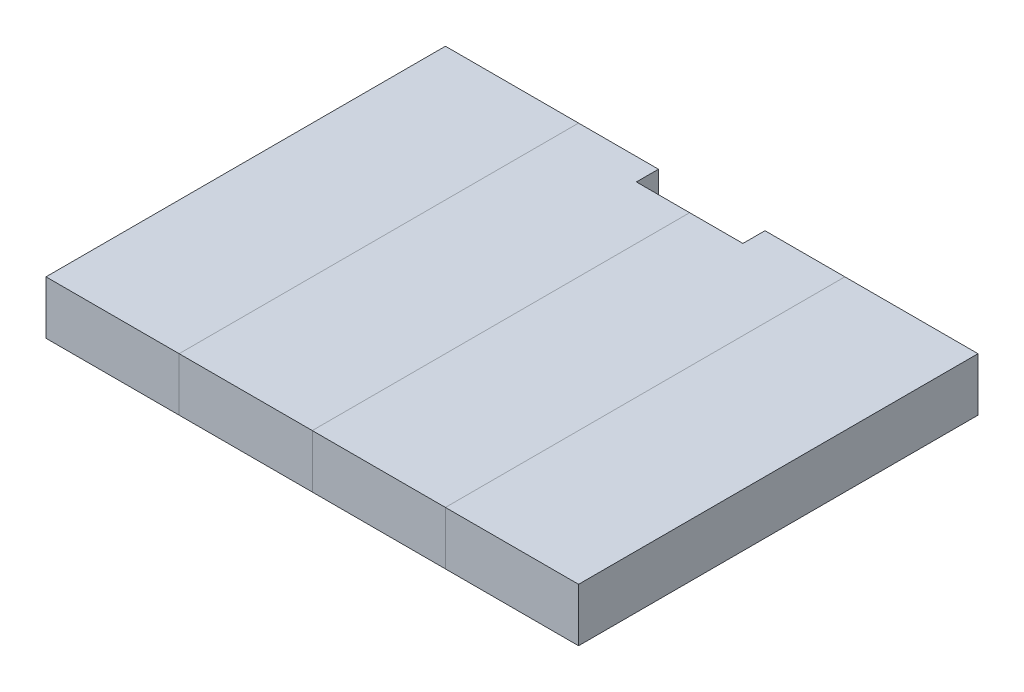
ISO-10303-21;
HEADER;
FILE_DESCRIPTION(('STEP AP214'),'2;1');
FILE_NAME('part.step','',(''),(''),'','','');
FILE_SCHEMA(('AUTOMOTIVE_DESIGN { 1 0 10303 214 1 1 1 1 }'));
ENDSEC;
DATA;
#1=APPLICATION_CONTEXT('core data for automotive mechanical design processes');
#2=APPLICATION_PROTOCOL_DEFINITION('international standard','automotive_design',2000,#1);
#3=PRODUCT_CONTEXT('',#1,'mechanical');
#4=PRODUCT('Part','Part','',(#3));
#5=PRODUCT_RELATED_PRODUCT_CATEGORY('part','',(#4));
#6=PRODUCT_DEFINITION_FORMATION('','',#4);
#7=PRODUCT_DEFINITION_CONTEXT('part definition',#1,'design');
#8=PRODUCT_DEFINITION('design','',#6,#7);
#9=PRODUCT_DEFINITION_SHAPE('','',#8);
#10=(LENGTH_UNIT() NAMED_UNIT(*) SI_UNIT(.MILLI.,.METRE.));
#11=(NAMED_UNIT(*) PLANE_ANGLE_UNIT() SI_UNIT($,.RADIAN.));
#12=(NAMED_UNIT(*) SI_UNIT($,.STERADIAN.) SOLID_ANGLE_UNIT());
#13=UNCERTAINTY_MEASURE_WITH_UNIT(LENGTH_MEASURE(1.E-05),#10,'distance_accuracy_value','');
#14=(GEOMETRIC_REPRESENTATION_CONTEXT(3) GLOBAL_UNCERTAINTY_ASSIGNED_CONTEXT((#13)) GLOBAL_UNIT_ASSIGNED_CONTEXT((#10,
#11,#12)) REPRESENTATION_CONTEXT('',''));
#15=CARTESIAN_POINT('',(0.,0.,0.));
#16=DIRECTION('',(0.,0.,1.));
#17=DIRECTION('',(1.,0.,0.));
#18=AXIS2_PLACEMENT_3D('',#15,#16,#17);
#19=CARTESIAN_POINT('',(0.,0.,0.));
#20=DIRECTION('',(0.,1.,0.));
#21=DIRECTION('',(0.,0.,1.));
#22=AXIS2_PLACEMENT_3D('',#19,#20,#21);
#23=PLANE('',#22);
#24=DIRECTION('',(0.,0.,1.));
#25=VECTOR('',#24,1.);
#26=CARTESIAN_POINT('',(-12.5,0.,-37.5));
#27=LINE('',#26,#25);
#28=CARTESIAN_POINT('',(-12.5,0.,-37.5));
#29=VERTEX_POINT('',#28);
#30=CARTESIAN_POINT('',(-12.5,0.,37.5));
#31=VERTEX_POINT('',#30);
#32=EDGE_CURVE('P0_E78',#29,#31,#27,.T.);
#33=ORIENTED_EDGE('',*,*,#32,.F.);
#34=DIRECTION('',(-1.,0.,0.));
#35=VECTOR('',#34,1.);
#36=CARTESIAN_POINT('',(12.5,0.,-37.5));
#37=LINE('',#36,#35);
#38=CARTESIAN_POINT('',(12.5,0.,-37.5));
#39=VERTEX_POINT('',#38);
#40=EDGE_CURVE('P0_E54',#39,#29,#37,.T.);
#41=ORIENTED_EDGE('',*,*,#40,.F.);
#42=DIRECTION('',(0.,0.,-1.));
#43=VECTOR('',#42,1.);
#44=CARTESIAN_POINT('',(12.5,0.,37.5));
#45=LINE('',#44,#43);
#46=CARTESIAN_POINT('',(12.5,0.,37.5));
#47=VERTEX_POINT('',#46);
#48=EDGE_CURVE('P0_E56',#47,#39,#45,.T.);
#49=ORIENTED_EDGE('',*,*,#48,.F.);
#50=DIRECTION('',(1.,0.,0.));
#51=VECTOR('',#50,1.);
#52=CARTESIAN_POINT('',(-12.5,0.,37.5));
#53=LINE('',#52,#51);
#54=EDGE_CURVE('P0_E19',#31,#47,#53,.T.);
#55=ORIENTED_EDGE('',*,*,#54,.F.);
#56=EDGE_LOOP('',(#33,#41,#49,#55));
#57=FACE_BOUND('',#56,.T.);
#58=ADVANCED_FACE('P0_F16',(#57),#23,.F.);
#59=CARTESIAN_POINT('',(-12.5,0.,37.5));
#60=DIRECTION('',(0.,0.,1.));
#61=DIRECTION('',(1.,0.,0.));
#62=AXIS2_PLACEMENT_3D('',#59,#60,#61);
#63=PLANE('',#62);
#64=DIRECTION('',(1.,0.,0.));
#65=VECTOR('',#64,1.);
#66=CARTESIAN_POINT('',(0.,10.,37.5));
#67=LINE('',#66,#65);
#68=CARTESIAN_POINT('',(-12.5,10.,37.5));
#69=VERTEX_POINT('',#68);
#70=CARTESIAN_POINT('',(12.5,10.,37.5));
#71=VERTEX_POINT('',#70);
#72=EDGE_CURVE('P0_E82',#69,#71,#67,.T.);
#73=ORIENTED_EDGE('',*,*,#72,.F.);
#74=DIRECTION('',(0.,1.,0.));
#75=VECTOR('',#74,1.);
#76=CARTESIAN_POINT('',(-12.5,0.,37.5));
#77=LINE('',#76,#75);
#78=EDGE_CURVE('P0_E67',#31,#69,#77,.T.);
#79=ORIENTED_EDGE('',*,*,#78,.F.);
#80=ORIENTED_EDGE('',*,*,#54,.T.);
#81=DIRECTION('',(0.,1.,0.));
#82=VECTOR('',#81,1.);
#83=CARTESIAN_POINT('',(12.5,0.,37.5));
#84=LINE('',#83,#82);
#85=EDGE_CURVE('P0_E62',#71,#47,#84,.F.);
#86=ORIENTED_EDGE('',*,*,#85,.F.);
#87=EDGE_LOOP('',(#73,#79,#80,#86));
#88=FACE_BOUND('',#87,.T.);
#89=ADVANCED_FACE('P0_F64',(#88),#63,.T.);
#90=CARTESIAN_POINT('',(12.5,0.,37.5));
#91=DIRECTION('',(1.,0.,0.));
#92=DIRECTION('',(0.,0.,-1.));
#93=AXIS2_PLACEMENT_3D('',#90,#91,#92);
#94=PLANE('',#93);
#95=DIRECTION('',(0.,0.,1.));
#96=VECTOR('',#95,1.);
#97=CARTESIAN_POINT('',(12.5,10.,0.));
#98=LINE('',#97,#96);
#99=CARTESIAN_POINT('',(12.5,10.,-37.5));
#100=VERTEX_POINT('',#99);
#101=EDGE_CURVE('P0_E71',#71,#100,#98,.F.);
#102=ORIENTED_EDGE('',*,*,#101,.F.);
#103=ORIENTED_EDGE('',*,*,#85,.T.);
#104=ORIENTED_EDGE('',*,*,#48,.T.);
#105=DIRECTION('',(0.,1.,0.));
#106=VECTOR('',#105,1.);
#107=CARTESIAN_POINT('',(12.5,0.,-37.5));
#108=LINE('',#107,#106);
#109=EDGE_CURVE('P0_E74',#100,#39,#108,.F.);
#110=ORIENTED_EDGE('',*,*,#109,.F.);
#111=EDGE_LOOP('',(#102,#103,#104,#110));
#112=FACE_BOUND('',#111,.T.);
#113=ADVANCED_FACE('P0_F69',(#112),#94,.T.);
#114=CARTESIAN_POINT('',(12.5,0.,-37.5));
#115=DIRECTION('',(0.,0.,-1.));
#116=DIRECTION('',(-1.,0.,0.));
#117=AXIS2_PLACEMENT_3D('',#114,#115,#116);
#118=PLANE('',#117);
#119=DIRECTION('',(1.,0.,0.));
#120=VECTOR('',#119,1.);
#121=CARTESIAN_POINT('',(0.,10.,-37.5));
#122=LINE('',#121,#120);
#123=CARTESIAN_POINT('',(-12.5,10.,-37.5));
#124=VERTEX_POINT('',#123);
#125=EDGE_CURVE('P0_E25',#100,#124,#122,.F.);
#126=ORIENTED_EDGE('',*,*,#125,.F.);
#127=ORIENTED_EDGE('',*,*,#109,.T.);
#128=ORIENTED_EDGE('',*,*,#40,.T.);
#129=DIRECTION('',(0.,1.,0.));
#130=VECTOR('',#129,1.);
#131=CARTESIAN_POINT('',(-12.5,0.,-37.5));
#132=LINE('',#131,#130);
#133=EDGE_CURVE('P0_E34',#124,#29,#132,.F.);
#134=ORIENTED_EDGE('',*,*,#133,.F.);
#135=EDGE_LOOP('',(#126,#127,#128,#134));
#136=FACE_BOUND('',#135,.T.);
#137=ADVANCED_FACE('P0_F88',(#136),#118,.T.);
#138=CARTESIAN_POINT('',(-12.5,0.,-37.5));
#139=DIRECTION('',(-1.,0.,0.));
#140=DIRECTION('',(0.,0.,1.));
#141=AXIS2_PLACEMENT_3D('',#138,#139,#140);
#142=PLANE('',#141);
#143=DIRECTION('',(0.,0.,1.));
#144=VECTOR('',#143,1.);
#145=CARTESIAN_POINT('',(-12.5,10.,0.));
#146=LINE('',#145,#144);
#147=EDGE_CURVE('P0_E10',#124,#69,#146,.T.);
#148=ORIENTED_EDGE('',*,*,#147,.F.);
#149=ORIENTED_EDGE('',*,*,#133,.T.);
#150=ORIENTED_EDGE('',*,*,#32,.T.);
#151=ORIENTED_EDGE('',*,*,#78,.T.);
#152=EDGE_LOOP('',(#148,#149,#150,#151));
#153=FACE_BOUND('',#152,.T.);
#154=ADVANCED_FACE('P0_F90',(#153),#142,.T.);
#155=CARTESIAN_POINT('',(0.,10.,0.));
#156=DIRECTION('',(0.,1.,0.));
#157=DIRECTION('',(0.,0.,1.));
#158=AXIS2_PLACEMENT_3D('',#155,#156,#157);
#159=PLANE('',#158);
#160=ORIENTED_EDGE('',*,*,#125,.T.);
#161=ORIENTED_EDGE('',*,*,#147,.T.);
#162=ORIENTED_EDGE('',*,*,#72,.T.);
#163=ORIENTED_EDGE('',*,*,#101,.T.);
#164=EDGE_LOOP('',(#160,#161,#162,#163));
#165=FACE_BOUND('',#164,.T.);
#166=ADVANCED_FACE('P0_F87',(#165),#159,.T.);
#167=CLOSED_SHELL('',(#58,#89,#113,#137,#154,#166));
#168=MANIFOLD_SOLID_BREP('P0_B1',#167);
#169=CARTESIAN_POINT('',(75.,0.,0.));
#170=DIRECTION('',(0.,1.,0.));
#171=DIRECTION('',(0.,0.,1.));
#172=AXIS2_PLACEMENT_3D('',#169,#170,#171);
#173=PLANE('',#172);
#174=DIRECTION('',(0.,0.,1.));
#175=VECTOR('',#174,1.);
#176=CARTESIAN_POINT('',(62.5,0.,-37.5));
#177=LINE('',#176,#175);
#178=CARTESIAN_POINT('',(62.5,0.,-37.5));
#179=VERTEX_POINT('',#178);
#180=CARTESIAN_POINT('',(62.5,0.,37.5));
#181=VERTEX_POINT('',#180);
#182=EDGE_CURVE('P1_E79',#179,#181,#177,.T.);
#183=ORIENTED_EDGE('',*,*,#182,.F.);
#184=DIRECTION('',(-1.,0.,0.));
#185=VECTOR('',#184,1.);
#186=CARTESIAN_POINT('',(87.5,0.,-37.5));
#187=LINE('',#186,#185);
#188=CARTESIAN_POINT('',(87.5,0.,-37.5));
#189=VERTEX_POINT('',#188);
#190=EDGE_CURVE('P1_E55',#189,#179,#187,.T.);
#191=ORIENTED_EDGE('',*,*,#190,.F.);
#192=DIRECTION('',(0.,0.,-1.));
#193=VECTOR('',#192,1.);
#194=CARTESIAN_POINT('',(87.5,0.,37.5));
#195=LINE('',#194,#193);
#196=CARTESIAN_POINT('',(87.5,0.,37.5));
#197=VERTEX_POINT('',#196);
#198=EDGE_CURVE('P1_E57',#197,#189,#195,.T.);
#199=ORIENTED_EDGE('',*,*,#198,.F.);
#200=DIRECTION('',(1.,0.,0.));
#201=VECTOR('',#200,1.);
#202=CARTESIAN_POINT('',(62.5,0.,37.5));
#203=LINE('',#202,#201);
#204=EDGE_CURVE('P1_E20',#181,#197,#203,.T.);
#205=ORIENTED_EDGE('',*,*,#204,.F.);
#206=EDGE_LOOP('',(#183,#191,#199,#205));
#207=FACE_BOUND('',#206,.T.);
#208=ADVANCED_FACE('P1_F17',(#207),#173,.F.);
#209=CARTESIAN_POINT('',(62.5,0.,37.5));
#210=DIRECTION('',(0.,0.,1.));
#211=DIRECTION('',(1.,0.,0.));
#212=AXIS2_PLACEMENT_3D('',#209,#210,#211);
#213=PLANE('',#212);
#214=DIRECTION('',(1.,0.,0.));
#215=VECTOR('',#214,1.);
#216=CARTESIAN_POINT('',(75.,10.,37.5));
#217=LINE('',#216,#215);
#218=CARTESIAN_POINT('',(62.5,10.,37.5));
#219=VERTEX_POINT('',#218);
#220=CARTESIAN_POINT('',(87.5,10.,37.5));
#221=VERTEX_POINT('',#220);
#222=EDGE_CURVE('P1_E83',#219,#221,#217,.T.);
#223=ORIENTED_EDGE('',*,*,#222,.F.);
#224=DIRECTION('',(0.,1.,0.));
#225=VECTOR('',#224,1.);
#226=CARTESIAN_POINT('',(62.5,0.,37.5));
#227=LINE('',#226,#225);
#228=EDGE_CURVE('P1_E68',#181,#219,#227,.T.);
#229=ORIENTED_EDGE('',*,*,#228,.F.);
#230=ORIENTED_EDGE('',*,*,#204,.T.);
#231=DIRECTION('',(0.,1.,0.));
#232=VECTOR('',#231,1.);
#233=CARTESIAN_POINT('',(87.5,0.,37.5));
#234=LINE('',#233,#232);
#235=EDGE_CURVE('P1_E63',#221,#197,#234,.F.);
#236=ORIENTED_EDGE('',*,*,#235,.F.);
#237=EDGE_LOOP('',(#223,#229,#230,#236));
#238=FACE_BOUND('',#237,.T.);
#239=ADVANCED_FACE('P1_F65',(#238),#213,.T.);
#240=CARTESIAN_POINT('',(87.5,0.,37.5));
#241=DIRECTION('',(1.,0.,0.));
#242=DIRECTION('',(0.,0.,-1.));
#243=AXIS2_PLACEMENT_3D('',#240,#241,#242);
#244=PLANE('',#243);
#245=DIRECTION('',(0.,0.,1.));
#246=VECTOR('',#245,1.);
#247=CARTESIAN_POINT('',(87.5,10.,0.));
#248=LINE('',#247,#246);
#249=CARTESIAN_POINT('',(87.5,10.,-37.5));
#250=VERTEX_POINT('',#249);
#251=EDGE_CURVE('P1_E72',#221,#250,#248,.F.);
#252=ORIENTED_EDGE('',*,*,#251,.F.);
#253=ORIENTED_EDGE('',*,*,#235,.T.);
#254=ORIENTED_EDGE('',*,*,#198,.T.);
#255=DIRECTION('',(0.,1.,0.));
#256=VECTOR('',#255,1.);
#257=CARTESIAN_POINT('',(87.5,0.,-37.5));
#258=LINE('',#257,#256);
#259=EDGE_CURVE('P1_E75',#250,#189,#258,.F.);
#260=ORIENTED_EDGE('',*,*,#259,.F.);
#261=EDGE_LOOP('',(#252,#253,#254,#260));
#262=FACE_BOUND('',#261,.T.);
#263=ADVANCED_FACE('P1_F70',(#262),#244,.T.);
#264=CARTESIAN_POINT('',(87.5,0.,-37.5));
#265=DIRECTION('',(0.,0.,-1.));
#266=DIRECTION('',(-1.,0.,0.));
#267=AXIS2_PLACEMENT_3D('',#264,#265,#266);
#268=PLANE('',#267);
#269=DIRECTION('',(1.,0.,0.));
#270=VECTOR('',#269,1.);
#271=CARTESIAN_POINT('',(75.,10.,-37.5));
#272=LINE('',#271,#270);
#273=CARTESIAN_POINT('',(62.5,10.,-37.5));
#274=VERTEX_POINT('',#273);
#275=EDGE_CURVE('P1_E26',#250,#274,#272,.F.);
#276=ORIENTED_EDGE('',*,*,#275,.F.);
#277=ORIENTED_EDGE('',*,*,#259,.T.);
#278=ORIENTED_EDGE('',*,*,#190,.T.);
#279=DIRECTION('',(0.,1.,0.));
#280=VECTOR('',#279,1.);
#281=CARTESIAN_POINT('',(62.5,0.,-37.5));
#282=LINE('',#281,#280);
#283=EDGE_CURVE('P1_E35',#274,#179,#282,.F.);
#284=ORIENTED_EDGE('',*,*,#283,.F.);
#285=EDGE_LOOP('',(#276,#277,#278,#284));
#286=FACE_BOUND('',#285,.T.);
#287=ADVANCED_FACE('P1_F89',(#286),#268,.T.);
#288=CARTESIAN_POINT('',(62.5,0.,-37.5));
#289=DIRECTION('',(-1.,0.,0.));
#290=DIRECTION('',(0.,0.,1.));
#291=AXIS2_PLACEMENT_3D('',#288,#289,#290);
#292=PLANE('',#291);
#293=DIRECTION('',(0.,0.,1.));
#294=VECTOR('',#293,1.);
#295=CARTESIAN_POINT('',(62.5,10.,0.));
#296=LINE('',#295,#294);
#297=EDGE_CURVE('P1_E11',#274,#219,#296,.T.);
#298=ORIENTED_EDGE('',*,*,#297,.F.);
#299=ORIENTED_EDGE('',*,*,#283,.T.);
#300=ORIENTED_EDGE('',*,*,#182,.T.);
#301=ORIENTED_EDGE('',*,*,#228,.T.);
#302=EDGE_LOOP('',(#298,#299,#300,#301));
#303=FACE_BOUND('',#302,.T.);
#304=ADVANCED_FACE('P1_F91',(#303),#292,.T.);
#305=CARTESIAN_POINT('',(75.,10.,0.));
#306=DIRECTION('',(0.,1.,0.));
#307=DIRECTION('',(0.,0.,1.));
#308=AXIS2_PLACEMENT_3D('',#305,#306,#307);
#309=PLANE('',#308);
#310=ORIENTED_EDGE('',*,*,#275,.T.);
#311=ORIENTED_EDGE('',*,*,#297,.T.);
#312=ORIENTED_EDGE('',*,*,#222,.T.);
#313=ORIENTED_EDGE('',*,*,#251,.T.);
#314=EDGE_LOOP('',(#310,#311,#312,#313));
#315=FACE_BOUND('',#314,.T.);
#316=ADVANCED_FACE('P1_F88',(#315),#309,.T.);
#317=CLOSED_SHELL('',(#208,#239,#263,#287,#304,#316));
#318=MANIFOLD_SOLID_BREP('P1_B1',#317);
#319=CARTESIAN_POINT('',(25.,0.,0.));
#320=DIRECTION('',(0.,1.,0.));
#321=DIRECTION('',(0.,0.,1.));
#322=AXIS2_PLACEMENT_3D('',#319,#320,#321);
#323=PLANE('',#322);
#324=DIRECTION('',(0.,0.,-1.));
#325=VECTOR('',#324,1.);
#326=CARTESIAN_POINT('',(37.5,0.,37.5));
#327=LINE('',#326,#325);
#328=CARTESIAN_POINT('',(37.5,0.,37.5));
#329=VERTEX_POINT('',#328);
#330=CARTESIAN_POINT('',(37.5,0.,-23.3578643762688));
#331=VERTEX_POINT('',#330);
#332=EDGE_CURVE('P2_E105',#329,#331,#327,.T.);
#333=ORIENTED_EDGE('',*,*,#332,.F.);
#334=DIRECTION('',(1.,0.,0.));
#335=VECTOR('',#334,1.);
#336=CARTESIAN_POINT('',(12.5,0.,37.5));
#337=LINE('',#336,#335);
#338=CARTESIAN_POINT('',(12.5,0.,37.5));
#339=VERTEX_POINT('',#338);
#340=EDGE_CURVE('P2_E98',#339,#329,#337,.T.);
#341=ORIENTED_EDGE('',*,*,#340,.F.);
#342=DIRECTION('',(0.,0.,1.));
#343=VECTOR('',#342,1.);
#344=CARTESIAN_POINT('',(12.5,0.,-37.5));
#345=LINE('',#344,#343);
#346=CARTESIAN_POINT('',(12.5,0.,-37.5));
#347=VERTEX_POINT('',#346);
#348=EDGE_CURVE('P2_E92',#347,#339,#345,.T.);
#349=ORIENTED_EDGE('',*,*,#348,.F.);
#350=DIRECTION('',(-1.,0.,0.));
#351=VECTOR('',#350,1.);
#352=CARTESIAN_POINT('',(37.5,0.,-37.5));
#353=LINE('',#352,#351);
#354=CARTESIAN_POINT('',(27.5,0.,-37.5));
#355=VERTEX_POINT('',#354);
#356=EDGE_CURVE('P2_E81',#355,#347,#353,.T.);
#357=ORIENTED_EDGE('',*,*,#356,.F.);
#358=DIRECTION('',(0.,0.,1.));
#359=VECTOR('',#358,1.);
#360=CARTESIAN_POINT('',(27.5,0.,50.8883476483183));
#361=LINE('',#360,#359);
#362=CARTESIAN_POINT('',(27.5,0.,-23.3578643762688));
#363=VERTEX_POINT('',#362);
#364=EDGE_CURVE('P2_E67',#355,#363,#361,.T.);
#365=ORIENTED_EDGE('',*,*,#364,.T.);
#366=DIRECTION('',(1.,0.,0.));
#367=VECTOR('',#366,1.);
#368=CARTESIAN_POINT('',(27.5,0.,-23.3578643762688));
#369=LINE('',#368,#367);
#370=EDGE_CURVE('P2_E20',#363,#331,#369,.T.);
#371=ORIENTED_EDGE('',*,*,#370,.T.);
#372=EDGE_LOOP('',(#333,#341,#349,#357,#365,#371));
#373=FACE_BOUND('',#372,.T.);
#374=ADVANCED_FACE('P2_F17',(#373),#323,.F.);
#375=CARTESIAN_POINT('',(27.5,-88.388347648318,65.0304832720493));
#376=DIRECTION('',(0.,0.707106781186548,0.707106781186547));
#377=DIRECTION('',(0.,-0.707106781186547,0.707106781186548));
#378=AXIS2_PLACEMENT_3D('',#375,#376,#377);
#379=PLANE('',#378);
#380=DIRECTION('',(0.,0.707106781186547,-0.707106781186547));
#381=VECTOR('',#380,1.);
#382=CARTESIAN_POINT('',(27.5,0.,-23.3578643762688));
#383=LINE('',#382,#381);
#384=CARTESIAN_POINT('',(27.5,9.99999999999999,-33.3578643762688));
#385=VERTEX_POINT('',#384);
#386=EDGE_CURVE('P2_E73',#363,#385,#383,.T.);
#387=ORIENTED_EDGE('',*,*,#386,.T.);
#388=DIRECTION('',(1.,0.,0.));
#389=VECTOR('',#388,1.);
#390=CARTESIAN_POINT('',(25.,10.,-33.3578643762688));
#391=LINE('',#390,#389);
#392=CARTESIAN_POINT('',(37.5,9.99999999999999,-33.3578643762688));
#393=VERTEX_POINT('',#392);
#394=EDGE_CURVE('P2_E107',#393,#385,#391,.F.);
#395=ORIENTED_EDGE('',*,*,#394,.F.);
#396=DIRECTION('',(0.,0.707106781186547,-0.707106781186548));
#397=VECTOR('',#396,1.);
#398=CARTESIAN_POINT('',(37.5,0.,-23.3578643762688));
#399=LINE('',#398,#397);
#400=EDGE_CURVE('P2_E76',#331,#393,#399,.T.);
#401=ORIENTED_EDGE('',*,*,#400,.F.);
#402=ORIENTED_EDGE('',*,*,#370,.F.);
#403=EDGE_LOOP('',(#387,#395,#401,#402));
#404=FACE_BOUND('',#403,.T.);
#405=ADVANCED_FACE('P2_F72',(#404),#379,.F.);
#406=CARTESIAN_POINT('',(27.5,-102.530483272049,50.8883476483183));
#407=DIRECTION('',(-1.,0.,0.));
#408=DIRECTION('',(0.,-1.,0.));
#409=AXIS2_PLACEMENT_3D('',#406,#407,#408);
#410=PLANE('',#409);
#411=DIRECTION('',(0.,1.,0.));
#412=VECTOR('',#411,1.);
#413=CARTESIAN_POINT('',(27.5,0.,-37.5));
#414=LINE('',#413,#412);
#415=CARTESIAN_POINT('',(27.5,10.,-37.5));
#416=VERTEX_POINT('',#415);
#417=EDGE_CURVE('P2_E83',#416,#355,#414,.F.);
#418=ORIENTED_EDGE('',*,*,#417,.F.);
#419=DIRECTION('',(0.,0.,1.));
#420=VECTOR('',#419,1.);
#421=CARTESIAN_POINT('',(27.5,10.,0.));
#422=LINE('',#421,#420);
#423=EDGE_CURVE('P2_E87',#385,#416,#422,.F.);
#424=ORIENTED_EDGE('',*,*,#423,.F.);
#425=ORIENTED_EDGE('',*,*,#386,.F.);
#426=ORIENTED_EDGE('',*,*,#364,.F.);
#427=EDGE_LOOP('',(#418,#424,#425,#426));
#428=FACE_BOUND('',#427,.T.);
#429=ADVANCED_FACE('P2_F85',(#428),#410,.F.);
#430=CARTESIAN_POINT('',(37.5,0.,-37.5));
#431=DIRECTION('',(0.,0.,-1.));
#432=DIRECTION('',(-1.,0.,0.));
#433=AXIS2_PLACEMENT_3D('',#430,#431,#432);
#434=PLANE('',#433);
#435=DIRECTION('',(0.,1.,0.));
#436=VECTOR('',#435,1.);
#437=CARTESIAN_POINT('',(12.5,0.,-37.5));
#438=LINE('',#437,#436);
#439=CARTESIAN_POINT('',(12.5,10.,-37.5));
#440=VERTEX_POINT('',#439);
#441=EDGE_CURVE('P2_E95',#440,#347,#438,.F.);
#442=ORIENTED_EDGE('',*,*,#441,.F.);
#443=DIRECTION('',(1.,0.,0.));
#444=VECTOR('',#443,1.);
#445=CARTESIAN_POINT('',(25.,10.,-37.5));
#446=LINE('',#445,#444);
#447=EDGE_CURVE('P2_E110',#416,#440,#446,.F.);
#448=ORIENTED_EDGE('',*,*,#447,.F.);
#449=ORIENTED_EDGE('',*,*,#417,.T.);
#450=ORIENTED_EDGE('',*,*,#356,.T.);
#451=EDGE_LOOP('',(#442,#448,#449,#450));
#452=FACE_BOUND('',#451,.T.);
#453=ADVANCED_FACE('P2_F124',(#452),#434,.T.);
#454=CARTESIAN_POINT('',(12.5,0.,-37.5));
#455=DIRECTION('',(-1.,0.,0.));
#456=DIRECTION('',(0.,0.,1.));
#457=AXIS2_PLACEMENT_3D('',#454,#455,#456);
#458=PLANE('',#457);
#459=DIRECTION('',(0.,0.,1.));
#460=VECTOR('',#459,1.);
#461=CARTESIAN_POINT('',(12.5,10.,0.));
#462=LINE('',#461,#460);
#463=CARTESIAN_POINT('',(12.5,10.,37.5));
#464=VERTEX_POINT('',#463);
#465=EDGE_CURVE('P2_E113',#440,#464,#462,.T.);
#466=ORIENTED_EDGE('',*,*,#465,.F.);
#467=ORIENTED_EDGE('',*,*,#441,.T.);
#468=ORIENTED_EDGE('',*,*,#348,.T.);
#469=DIRECTION('',(0.,1.,0.));
#470=VECTOR('',#469,1.);
#471=CARTESIAN_POINT('',(12.5,0.,37.5));
#472=LINE('',#471,#470);
#473=EDGE_CURVE('P2_E100',#464,#339,#472,.F.);
#474=ORIENTED_EDGE('',*,*,#473,.F.);
#475=EDGE_LOOP('',(#466,#467,#468,#474));
#476=FACE_BOUND('',#475,.T.);
#477=ADVANCED_FACE('P2_F122',(#476),#458,.T.);
#478=CARTESIAN_POINT('',(12.5,0.,37.5));
#479=DIRECTION('',(0.,0.,1.));
#480=DIRECTION('',(1.,0.,0.));
#481=AXIS2_PLACEMENT_3D('',#478,#479,#480);
#482=PLANE('',#481);
#483=DIRECTION('',(1.,0.,0.));
#484=VECTOR('',#483,1.);
#485=CARTESIAN_POINT('',(25.,10.,37.5));
#486=LINE('',#485,#484);
#487=CARTESIAN_POINT('',(37.5,10.,37.5));
#488=VERTEX_POINT('',#487);
#489=EDGE_CURVE('P2_E26',#464,#488,#486,.T.);
#490=ORIENTED_EDGE('',*,*,#489,.F.);
#491=ORIENTED_EDGE('',*,*,#473,.T.);
#492=ORIENTED_EDGE('',*,*,#340,.T.);
#493=DIRECTION('',(0.,1.,0.));
#494=VECTOR('',#493,1.);
#495=CARTESIAN_POINT('',(37.5,0.,37.5));
#496=LINE('',#495,#494);
#497=EDGE_CURVE('P2_E35',#488,#329,#496,.F.);
#498=ORIENTED_EDGE('',*,*,#497,.F.);
#499=EDGE_LOOP('',(#490,#491,#492,#498));
#500=FACE_BOUND('',#499,.T.);
#501=ADVANCED_FACE('P2_F120',(#500),#482,.T.);
#502=CARTESIAN_POINT('',(37.5,0.,37.5));
#503=DIRECTION('',(1.,0.,0.));
#504=DIRECTION('',(0.,0.,-1.));
#505=AXIS2_PLACEMENT_3D('',#502,#503,#504);
#506=PLANE('',#505);
#507=ORIENTED_EDGE('',*,*,#497,.T.);
#508=ORIENTED_EDGE('',*,*,#332,.T.);
#509=ORIENTED_EDGE('',*,*,#400,.T.);
#510=DIRECTION('',(0.,0.,1.));
#511=VECTOR('',#510,1.);
#512=CARTESIAN_POINT('',(37.5,10.,0.));
#513=LINE('',#512,#511);
#514=EDGE_CURVE('P2_E11',#488,#393,#513,.F.);
#515=ORIENTED_EDGE('',*,*,#514,.F.);
#516=EDGE_LOOP('',(#507,#508,#509,#515));
#517=FACE_BOUND('',#516,.T.);
#518=ADVANCED_FACE('P2_F127',(#517),#506,.T.);
#519=CARTESIAN_POINT('',(25.,10.,0.));
#520=DIRECTION('',(0.,1.,0.));
#521=DIRECTION('',(0.,0.,1.));
#522=AXIS2_PLACEMENT_3D('',#519,#520,#521);
#523=PLANE('',#522);
#524=ORIENTED_EDGE('',*,*,#489,.T.);
#525=ORIENTED_EDGE('',*,*,#514,.T.);
#526=ORIENTED_EDGE('',*,*,#394,.T.);
#527=ORIENTED_EDGE('',*,*,#423,.T.);
#528=ORIENTED_EDGE('',*,*,#447,.T.);
#529=ORIENTED_EDGE('',*,*,#465,.T.);
#530=EDGE_LOOP('',(#524,#525,#526,#527,#528,#529));
#531=FACE_BOUND('',#530,.T.);
#532=ADVANCED_FACE('P2_F118',(#531),#523,.T.);
#533=CLOSED_SHELL('',(#374,#405,#429,#453,#477,#501,#518,#532));
#534=MANIFOLD_SOLID_BREP('P2_B1',#533);
#535=CARTESIAN_POINT('',(50.,0.,0.));
#536=DIRECTION('',(0.,1.,0.));
#537=DIRECTION('',(0.,0.,1.));
#538=AXIS2_PLACEMENT_3D('',#535,#536,#537);
#539=PLANE('',#538);
#540=DIRECTION('',(0.,0.,1.));
#541=VECTOR('',#540,1.);
#542=CARTESIAN_POINT('',(47.5,0.,65.0304832720493));
#543=LINE('',#542,#541);
#544=CARTESIAN_POINT('',(47.5,0.,-23.3578643762688));
#545=VERTEX_POINT('',#544);
#546=CARTESIAN_POINT('',(47.5,0.,-37.5));
#547=VERTEX_POINT('',#546);
#548=EDGE_CURVE('P3_E103',#545,#547,#543,.F.);
#549=ORIENTED_EDGE('',*,*,#548,.T.);
#550=DIRECTION('',(-1.,0.,0.));
#551=VECTOR('',#550,1.);
#552=CARTESIAN_POINT('',(62.5,0.,-37.5));
#553=LINE('',#552,#551);
#554=CARTESIAN_POINT('',(62.5,0.,-37.5));
#555=VERTEX_POINT('',#554);
#556=EDGE_CURVE('P3_E100',#555,#547,#553,.T.);
#557=ORIENTED_EDGE('',*,*,#556,.F.);
#558=DIRECTION('',(0.,0.,-1.));
#559=VECTOR('',#558,1.);
#560=CARTESIAN_POINT('',(62.5,0.,37.5));
#561=LINE('',#560,#559);
#562=CARTESIAN_POINT('',(62.5,0.,37.5));
#563=VERTEX_POINT('',#562);
#564=EDGE_CURVE('P3_E92',#563,#555,#561,.T.);
#565=ORIENTED_EDGE('',*,*,#564,.F.);
#566=DIRECTION('',(1.,0.,0.));
#567=VECTOR('',#566,1.);
#568=CARTESIAN_POINT('',(37.5,0.,37.5));
#569=LINE('',#568,#567);
#570=CARTESIAN_POINT('',(37.5,0.,37.5));
#571=VERTEX_POINT('',#570);
#572=EDGE_CURVE('P3_E68',#571,#563,#569,.T.);
#573=ORIENTED_EDGE('',*,*,#572,.F.);
#574=DIRECTION('',(0.,0.,1.));
#575=VECTOR('',#574,1.);
#576=CARTESIAN_POINT('',(37.5,0.,-37.5));
#577=LINE('',#576,#575);
#578=CARTESIAN_POINT('',(37.5,0.,-23.3578643762688));
#579=VERTEX_POINT('',#578);
#580=EDGE_CURVE('P3_E80',#579,#571,#577,.T.);
#581=ORIENTED_EDGE('',*,*,#580,.F.);
#582=DIRECTION('',(1.,0.,0.));
#583=VECTOR('',#582,1.);
#584=CARTESIAN_POINT('',(27.5,0.,-23.3578643762688));
#585=LINE('',#584,#583);
#586=EDGE_CURVE('P3_E20',#579,#545,#585,.T.);
#587=ORIENTED_EDGE('',*,*,#586,.T.);
#588=EDGE_LOOP('',(#549,#557,#565,#573,#581,#587));
#589=FACE_BOUND('',#588,.T.);
#590=ADVANCED_FACE('P3_F17',(#589),#539,.F.);
#591=CARTESIAN_POINT('',(27.5,-88.388347648318,65.0304832720493));
#592=DIRECTION('',(0.,0.707106781186548,0.707106781186547));
#593=DIRECTION('',(0.,-0.707106781186547,0.707106781186548));
#594=AXIS2_PLACEMENT_3D('',#591,#592,#593);
#595=PLANE('',#594);
#596=DIRECTION('',(0.,-0.707106781186547,0.707106781186548));
#597=VECTOR('',#596,1.);
#598=CARTESIAN_POINT('',(47.5,9.99999999999999,-33.3578643762688));
#599=LINE('',#598,#597);
#600=CARTESIAN_POINT('',(47.5,9.99999999999999,-33.3578643762688));
#601=VERTEX_POINT('',#600);
#602=EDGE_CURVE('P3_E78',#601,#545,#599,.T.);
#603=ORIENTED_EDGE('',*,*,#602,.T.);
#604=ORIENTED_EDGE('',*,*,#586,.F.);
#605=DIRECTION('',(0.,-0.707106781186547,0.707106781186548));
#606=VECTOR('',#605,1.);
#607=CARTESIAN_POINT('',(37.5,10.,-33.3578643762688));
#608=LINE('',#607,#606);
#609=CARTESIAN_POINT('',(37.5,9.99999999999999,-33.3578643762688));
#610=VERTEX_POINT('',#609);
#611=EDGE_CURVE('P3_E75',#610,#579,#608,.T.);
#612=ORIENTED_EDGE('',*,*,#611,.F.);
#613=DIRECTION('',(1.,0.,0.));
#614=VECTOR('',#613,1.);
#615=CARTESIAN_POINT('',(50.,10.,-33.3578643762688));
#616=LINE('',#615,#614);
#617=EDGE_CURVE('P3_E106',#601,#610,#616,.F.);
#618=ORIENTED_EDGE('',*,*,#617,.F.);
#619=EDGE_LOOP('',(#603,#604,#612,#618));
#620=FACE_BOUND('',#619,.T.);
#621=ADVANCED_FACE('P3_F73',(#620),#595,.F.);
#622=CARTESIAN_POINT('',(37.5,0.,-37.5));
#623=DIRECTION('',(-1.,0.,0.));
#624=DIRECTION('',(0.,0.,1.));
#625=AXIS2_PLACEMENT_3D('',#622,#623,#624);
#626=PLANE('',#625);
#627=DIRECTION('',(0.,1.,0.));
#628=VECTOR('',#627,1.);
#629=CARTESIAN_POINT('',(37.5,0.,37.5));
#630=LINE('',#629,#628);
#631=CARTESIAN_POINT('',(37.5,10.,37.5));
#632=VERTEX_POINT('',#631);
#633=EDGE_CURVE('P3_E90',#632,#571,#630,.F.);
#634=ORIENTED_EDGE('',*,*,#633,.F.);
#635=DIRECTION('',(0.,0.,1.));
#636=VECTOR('',#635,1.);
#637=CARTESIAN_POINT('',(37.5,10.,0.));
#638=LINE('',#637,#636);
#639=EDGE_CURVE('P3_E86',#610,#632,#638,.T.);
#640=ORIENTED_EDGE('',*,*,#639,.F.);
#641=ORIENTED_EDGE('',*,*,#611,.T.);
#642=ORIENTED_EDGE('',*,*,#580,.T.);
#643=EDGE_LOOP('',(#634,#640,#641,#642));
#644=FACE_BOUND('',#643,.T.);
#645=ADVANCED_FACE('P3_F84',(#644),#626,.T.);
#646=CARTESIAN_POINT('',(37.5,0.,37.5));
#647=DIRECTION('',(0.,0.,1.));
#648=DIRECTION('',(1.,0.,0.));
#649=AXIS2_PLACEMENT_3D('',#646,#647,#648);
#650=PLANE('',#649);
#651=DIRECTION('',(1.,0.,0.));
#652=VECTOR('',#651,1.);
#653=CARTESIAN_POINT('',(50.,10.,37.5));
#654=LINE('',#653,#652);
#655=CARTESIAN_POINT('',(62.5,10.,37.5));
#656=VERTEX_POINT('',#655);
#657=EDGE_CURVE('P3_E109',#632,#656,#654,.T.);
#658=ORIENTED_EDGE('',*,*,#657,.F.);
#659=ORIENTED_EDGE('',*,*,#633,.T.);
#660=ORIENTED_EDGE('',*,*,#572,.T.);
#661=DIRECTION('',(0.,1.,0.));
#662=VECTOR('',#661,1.);
#663=CARTESIAN_POINT('',(62.5,0.,37.5));
#664=LINE('',#663,#662);
#665=EDGE_CURVE('P3_E94',#656,#563,#664,.F.);
#666=ORIENTED_EDGE('',*,*,#665,.F.);
#667=EDGE_LOOP('',(#658,#659,#660,#666));
#668=FACE_BOUND('',#667,.T.);
#669=ADVANCED_FACE('P3_F137',(#668),#650,.T.);
#670=CARTESIAN_POINT('',(62.5,0.,37.5));
#671=DIRECTION('',(1.,0.,0.));
#672=DIRECTION('',(0.,0.,-1.));
#673=AXIS2_PLACEMENT_3D('',#670,#671,#672);
#674=PLANE('',#673);
#675=DIRECTION('',(0.,0.,1.));
#676=VECTOR('',#675,1.);
#677=CARTESIAN_POINT('',(62.5,10.,0.));
#678=LINE('',#677,#676);
#679=CARTESIAN_POINT('',(62.5,10.,-37.5));
#680=VERTEX_POINT('',#679);
#681=EDGE_CURVE('P3_E112',#656,#680,#678,.F.);
#682=ORIENTED_EDGE('',*,*,#681,.F.);
#683=ORIENTED_EDGE('',*,*,#665,.T.);
#684=ORIENTED_EDGE('',*,*,#564,.T.);
#685=DIRECTION('',(0.,1.,0.));
#686=VECTOR('',#685,1.);
#687=CARTESIAN_POINT('',(62.5,0.,-37.5));
#688=LINE('',#687,#686);
#689=EDGE_CURVE('P3_E97',#680,#555,#688,.F.);
#690=ORIENTED_EDGE('',*,*,#689,.F.);
#691=EDGE_LOOP('',(#682,#683,#684,#690));
#692=FACE_BOUND('',#691,.T.);
#693=ADVANCED_FACE('P3_F122',(#692),#674,.T.);
#694=CARTESIAN_POINT('',(62.5,0.,-37.5));
#695=DIRECTION('',(0.,0.,-1.));
#696=DIRECTION('',(-1.,0.,0.));
#697=AXIS2_PLACEMENT_3D('',#694,#695,#696);
#698=PLANE('',#697);
#699=ORIENTED_EDGE('',*,*,#689,.T.);
#700=ORIENTED_EDGE('',*,*,#556,.T.);
#701=DIRECTION('',(0.,1.,0.));
#702=VECTOR('',#701,1.);
#703=CARTESIAN_POINT('',(47.5,-88.388347648318,-37.5));
#704=LINE('',#703,#702);
#705=CARTESIAN_POINT('',(47.5,10.,-37.5));
#706=VERTEX_POINT('',#705);
#707=EDGE_CURVE('P3_E35',#547,#706,#704,.T.);
#708=ORIENTED_EDGE('',*,*,#707,.T.);
#709=DIRECTION('',(1.,0.,0.));
#710=VECTOR('',#709,1.);
#711=CARTESIAN_POINT('',(50.,10.,-37.5));
#712=LINE('',#711,#710);
#713=EDGE_CURVE('P3_E26',#680,#706,#712,.F.);
#714=ORIENTED_EDGE('',*,*,#713,.F.);
#715=EDGE_LOOP('',(#699,#700,#708,#714));
#716=FACE_BOUND('',#715,.T.);
#717=ADVANCED_FACE('P3_F119',(#716),#698,.T.);
#718=CARTESIAN_POINT('',(47.5,-88.388347648318,65.0304832720493));
#719=DIRECTION('',(1.,0.,0.));
#720=DIRECTION('',(0.,1.,0.));
#721=AXIS2_PLACEMENT_3D('',#718,#719,#720);
#722=PLANE('',#721);
#723=ORIENTED_EDGE('',*,*,#707,.F.);
#724=ORIENTED_EDGE('',*,*,#548,.F.);
#725=ORIENTED_EDGE('',*,*,#602,.F.);
#726=DIRECTION('',(0.,0.,1.));
#727=VECTOR('',#726,1.);
#728=CARTESIAN_POINT('',(47.5,10.,0.));
#729=LINE('',#728,#727);
#730=EDGE_CURVE('P3_E11',#706,#601,#729,.T.);
#731=ORIENTED_EDGE('',*,*,#730,.F.);
#732=EDGE_LOOP('',(#723,#724,#725,#731));
#733=FACE_BOUND('',#732,.T.);
#734=ADVANCED_FACE('P3_F124',(#733),#722,.F.);
#735=CARTESIAN_POINT('',(50.,10.,0.));
#736=DIRECTION('',(0.,1.,0.));
#737=DIRECTION('',(0.,0.,1.));
#738=AXIS2_PLACEMENT_3D('',#735,#736,#737);
#739=PLANE('',#738);
#740=ORIENTED_EDGE('',*,*,#713,.T.);
#741=ORIENTED_EDGE('',*,*,#730,.T.);
#742=ORIENTED_EDGE('',*,*,#617,.T.);
#743=ORIENTED_EDGE('',*,*,#639,.T.);
#744=ORIENTED_EDGE('',*,*,#657,.T.);
#745=ORIENTED_EDGE('',*,*,#681,.T.);
#746=EDGE_LOOP('',(#740,#741,#742,#743,#744,#745));
#747=FACE_BOUND('',#746,.T.);
#748=ADVANCED_FACE('P3_F117',(#747),#739,.T.);
#749=CLOSED_SHELL('',(#590,#621,#645,#669,#693,#717,#734,#748));
#750=MANIFOLD_SOLID_BREP('P3_B1',#749);
#751=ADVANCED_BREP_SHAPE_REPRESENTATION('',(#18,#168,#318,#534,#750),#14);
#752=SHAPE_DEFINITION_REPRESENTATION(#9,#751);
ENDSEC;
END-ISO-10303-21;
